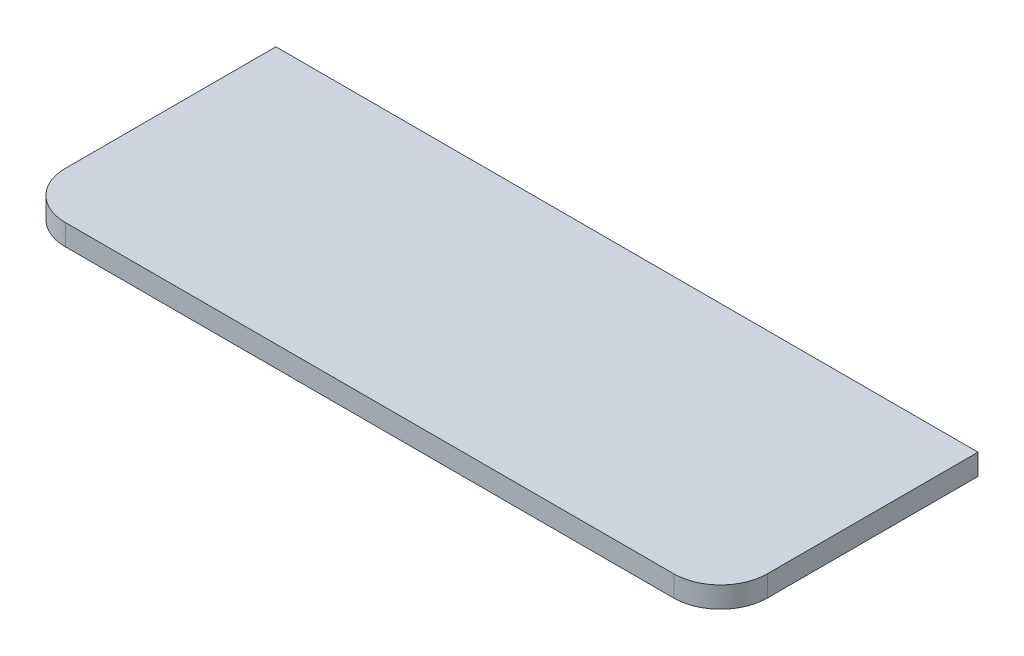
ISO-10303-21;
HEADER;
FILE_DESCRIPTION(('STEP AP214'),'2;1');
FILE_NAME('part.step','',(''),(''),'','','');
FILE_SCHEMA(('AUTOMOTIVE_DESIGN { 1 0 10303 214 1 1 1 1 }'));
ENDSEC;
DATA;
#1=APPLICATION_CONTEXT('core data for automotive mechanical design processes');
#2=APPLICATION_PROTOCOL_DEFINITION('international standard','automotive_design',2000,#1);
#3=PRODUCT_CONTEXT('',#1,'mechanical');
#4=PRODUCT('Part','Part','',(#3));
#5=PRODUCT_RELATED_PRODUCT_CATEGORY('part','',(#4));
#6=PRODUCT_DEFINITION_FORMATION('','',#4);
#7=PRODUCT_DEFINITION_CONTEXT('part definition',#1,'design');
#8=PRODUCT_DEFINITION('design','',#6,#7);
#9=PRODUCT_DEFINITION_SHAPE('','',#8);
#10=(LENGTH_UNIT() NAMED_UNIT(*) SI_UNIT(.MILLI.,.METRE.));
#11=(NAMED_UNIT(*) PLANE_ANGLE_UNIT() SI_UNIT($,.RADIAN.));
#12=(NAMED_UNIT(*) SI_UNIT($,.STERADIAN.) SOLID_ANGLE_UNIT());
#13=UNCERTAINTY_MEASURE_WITH_UNIT(LENGTH_MEASURE(1.E-05),#10,'distance_accuracy_value','');
#14=(GEOMETRIC_REPRESENTATION_CONTEXT(3) GLOBAL_UNCERTAINTY_ASSIGNED_CONTEXT((#13)) GLOBAL_UNIT_ASSIGNED_CONTEXT((#10,
#11,#12)) REPRESENTATION_CONTEXT('',''));
#15=CARTESIAN_POINT('',(0.,0.,0.));
#16=DIRECTION('',(0.,0.,1.));
#17=DIRECTION('',(1.,0.,0.));
#18=AXIS2_PLACEMENT_3D('',#15,#16,#17);
#19=CARTESIAN_POINT('',(-32.6549398788168,18.,-18.151418415666));
#20=DIRECTION('',(1.,0.,0.));
#21=DIRECTION('',(0.,0.,-1.));
#22=AXIS2_PLACEMENT_3D('',#19,#20,#21);
#23=PLANE('',#22);
#24=DIRECTION('',(0.,0.,1.));
#25=VECTOR('',#24,1.);
#26=CARTESIAN_POINT('',(-32.6549398788168,0.,-18.151418415666));
#27=LINE('',#26,#25);
#28=CARTESIAN_POINT('',(-32.6549398788168,0.,-18.151418415666));
#29=VERTEX_POINT('',#28);
#30=CARTESIAN_POINT('',(-32.6549398788168,0.,161.848581584334));
#31=VERTEX_POINT('',#30);
#32=EDGE_CURVE('E128',#29,#31,#27,.T.);
#33=ORIENTED_EDGE('',*,*,#32,.T.);
#34=DIRECTION('',(0.,-1.,0.));
#35=VECTOR('',#34,1.);
#36=CARTESIAN_POINT('',(-32.6549398788168,18.,161.848581584334));
#37=LINE('',#36,#35);
#38=CARTESIAN_POINT('',(-32.6549398788168,18.,161.848581584334));
#39=VERTEX_POINT('',#38);
#40=EDGE_CURVE('E13',#39,#31,#37,.T.);
#41=ORIENTED_EDGE('',*,*,#40,.F.);
#42=DIRECTION('',(0.,0.,1.));
#43=VECTOR('',#42,1.);
#44=CARTESIAN_POINT('',(-32.6549398788168,18.,-18.151418415666));
#45=LINE('',#44,#43);
#46=CARTESIAN_POINT('',(-32.6549398788168,18.,-18.151418415666));
#47=VERTEX_POINT('',#46);
#48=EDGE_CURVE('E138',#47,#39,#45,.T.);
#49=ORIENTED_EDGE('',*,*,#48,.F.);
#50=DIRECTION('',(0.,-1.,0.));
#51=VECTOR('',#50,1.);
#52=CARTESIAN_POINT('',(-32.6549398788168,18.,-18.151418415666));
#53=LINE('',#52,#51);
#54=EDGE_CURVE('E124',#47,#29,#53,.T.);
#55=ORIENTED_EDGE('',*,*,#54,.T.);
#56=EDGE_LOOP('',(#33,#41,#49,#55));
#57=FACE_BOUND('',#56,.T.);
#58=ADVANCED_FACE('F44',(#57),#23,.F.);
#59=CARTESIAN_POINT('',(7.34506012118324,18.,161.848581584334));
#60=DIRECTION('',(0.,-1.,0.));
#61=DIRECTION('',(0.,0.,-1.));
#62=AXIS2_PLACEMENT_3D('',#59,#60,#61);
#63=CYLINDRICAL_SURFACE('',#62,40.);
#64=CARTESIAN_POINT('',(7.34506012118324,0.,161.848581584334));
#65=DIRECTION('',(0.,1.,0.));
#66=DIRECTION('',(0.,0.,1.));
#67=AXIS2_PLACEMENT_3D('',#64,#65,#66);
#68=CIRCLE('',#67,40.);
#69=CARTESIAN_POINT('',(7.34506012118324,0.,201.848581584334));
#70=VERTEX_POINT('',#69);
#71=EDGE_CURVE('E131',#31,#70,#68,.T.);
#72=ORIENTED_EDGE('',*,*,#71,.T.);
#73=DIRECTION('',(0.,-1.,0.));
#74=VECTOR('',#73,1.);
#75=CARTESIAN_POINT('',(7.34506012118324,18.,201.848581584334));
#76=LINE('',#75,#74);
#77=CARTESIAN_POINT('',(7.34506012118324,18.,201.848581584334));
#78=VERTEX_POINT('',#77);
#79=EDGE_CURVE('E52',#78,#70,#76,.T.);
#80=ORIENTED_EDGE('',*,*,#79,.F.);
#81=CARTESIAN_POINT('',(7.34506012118324,18.,161.848581584334));
#82=DIRECTION('',(0.,1.,0.));
#83=DIRECTION('',(0.,0.,1.));
#84=AXIS2_PLACEMENT_3D('',#81,#82,#83);
#85=CIRCLE('',#84,40.);
#86=EDGE_CURVE('E97',#39,#78,#85,.T.);
#87=ORIENTED_EDGE('',*,*,#86,.F.);
#88=ORIENTED_EDGE('',*,*,#40,.T.);
#89=EDGE_LOOP('',(#72,#80,#87,#88));
#90=FACE_BOUND('',#89,.T.);
#91=ADVANCED_FACE('F162',(#90),#63,.T.);
#92=CARTESIAN_POINT('',(7.34506012118324,18.,201.848581584334));
#93=DIRECTION('',(0.,0.,-1.));
#94=DIRECTION('',(-1.,0.,0.));
#95=AXIS2_PLACEMENT_3D('',#92,#93,#94);
#96=PLANE('',#95);
#97=DIRECTION('',(1.,0.,0.));
#98=VECTOR('',#97,1.);
#99=CARTESIAN_POINT('',(7.34506012118324,0.,201.848581584334));
#100=LINE('',#99,#98);
#101=CARTESIAN_POINT('',(527.345060121183,0.,201.848581584334));
#102=VERTEX_POINT('',#101);
#103=EDGE_CURVE('E133',#70,#102,#100,.T.);
#104=ORIENTED_EDGE('',*,*,#103,.T.);
#105=DIRECTION('',(0.,-1.,0.));
#106=VECTOR('',#105,1.);
#107=CARTESIAN_POINT('',(527.345060121183,18.,201.848581584334));
#108=LINE('',#107,#106);
#109=CARTESIAN_POINT('',(527.345060121183,18.,201.848581584334));
#110=VERTEX_POINT('',#109);
#111=EDGE_CURVE('E119',#110,#102,#108,.T.);
#112=ORIENTED_EDGE('',*,*,#111,.F.);
#113=DIRECTION('',(1.,0.,0.));
#114=VECTOR('',#113,1.);
#115=CARTESIAN_POINT('',(7.34506012118324,18.,201.848581584334));
#116=LINE('',#115,#114);
#117=EDGE_CURVE('E110',#78,#110,#116,.T.);
#118=ORIENTED_EDGE('',*,*,#117,.F.);
#119=ORIENTED_EDGE('',*,*,#79,.T.);
#120=EDGE_LOOP('',(#104,#112,#118,#119));
#121=FACE_BOUND('',#120,.T.);
#122=ADVANCED_FACE('F144',(#121),#96,.F.);
#123=CARTESIAN_POINT('',(527.345060121183,18.,161.848581584334));
#124=DIRECTION('',(0.,-1.,0.));
#125=DIRECTION('',(0.,0.,-1.));
#126=AXIS2_PLACEMENT_3D('',#123,#124,#125);
#127=CYLINDRICAL_SURFACE('',#126,40.);
#128=CARTESIAN_POINT('',(527.345060121183,0.,161.848581584334));
#129=DIRECTION('',(0.,1.,0.));
#130=DIRECTION('',(0.,0.,1.));
#131=AXIS2_PLACEMENT_3D('',#128,#129,#130);
#132=CIRCLE('',#131,40.);
#133=CARTESIAN_POINT('',(567.345060121183,0.,161.848581584334));
#134=VERTEX_POINT('',#133);
#135=EDGE_CURVE('E118',#102,#134,#132,.T.);
#136=ORIENTED_EDGE('',*,*,#135,.T.);
#137=DIRECTION('',(0.,-1.,0.));
#138=VECTOR('',#137,1.);
#139=CARTESIAN_POINT('',(567.345060121183,18.,161.848581584334));
#140=LINE('',#139,#138);
#141=CARTESIAN_POINT('',(567.345060121183,18.,161.848581584334));
#142=VERTEX_POINT('',#141);
#143=EDGE_CURVE('E115',#142,#134,#140,.T.);
#144=ORIENTED_EDGE('',*,*,#143,.F.);
#145=CARTESIAN_POINT('',(527.345060121183,18.,161.848581584334));
#146=DIRECTION('',(0.,1.,0.));
#147=DIRECTION('',(0.,0.,1.));
#148=AXIS2_PLACEMENT_3D('',#145,#146,#147);
#149=CIRCLE('',#148,40.);
#150=EDGE_CURVE('E104',#110,#142,#149,.T.);
#151=ORIENTED_EDGE('',*,*,#150,.F.);
#152=ORIENTED_EDGE('',*,*,#111,.T.);
#153=EDGE_LOOP('',(#136,#144,#151,#152));
#154=FACE_BOUND('',#153,.T.);
#155=ADVANCED_FACE('F116',(#154),#127,.T.);
#156=CARTESIAN_POINT('',(567.345060121183,18.,-18.151418415666));
#157=DIRECTION('',(-1.,0.,0.));
#158=DIRECTION('',(0.,0.,1.));
#159=AXIS2_PLACEMENT_3D('',#156,#157,#158);
#160=PLANE('',#159);
#161=DIRECTION('',(0.,0.,-1.));
#162=VECTOR('',#161,1.);
#163=CARTESIAN_POINT('',(567.345060121183,0.,-18.151418415666));
#164=LINE('',#163,#162);
#165=CARTESIAN_POINT('',(567.345060121183,0.,-18.151418415666));
#166=VERTEX_POINT('',#165);
#167=EDGE_CURVE('E83',#134,#166,#164,.T.);
#168=ORIENTED_EDGE('',*,*,#167,.T.);
#169=DIRECTION('',(0.,-1.,0.));
#170=VECTOR('',#169,1.);
#171=CARTESIAN_POINT('',(567.345060121183,18.,-18.151418415666));
#172=LINE('',#171,#170);
#173=CARTESIAN_POINT('',(567.345060121183,18.,-18.151418415666));
#174=VERTEX_POINT('',#173);
#175=EDGE_CURVE('E120',#174,#166,#172,.T.);
#176=ORIENTED_EDGE('',*,*,#175,.F.);
#177=DIRECTION('',(0.,0.,-1.));
#178=VECTOR('',#177,1.);
#179=CARTESIAN_POINT('',(567.345060121183,18.,-18.151418415666));
#180=LINE('',#179,#178);
#181=EDGE_CURVE('E108',#142,#174,#180,.T.);
#182=ORIENTED_EDGE('',*,*,#181,.F.);
#183=ORIENTED_EDGE('',*,*,#143,.T.);
#184=EDGE_LOOP('',(#168,#176,#182,#183));
#185=FACE_BOUND('',#184,.T.);
#186=ADVANCED_FACE('F122',(#185),#160,.F.);
#187=CARTESIAN_POINT('',(-32.6549398788168,18.,-18.151418415666));
#188=DIRECTION('',(0.,0.,1.));
#189=DIRECTION('',(1.,0.,0.));
#190=AXIS2_PLACEMENT_3D('',#187,#188,#189);
#191=PLANE('',#190);
#192=DIRECTION('',(-1.,0.,0.));
#193=VECTOR('',#192,1.);
#194=CARTESIAN_POINT('',(-32.6549398788168,0.,-18.151418415666));
#195=LINE('',#194,#193);
#196=EDGE_CURVE('E89',#166,#29,#195,.T.);
#197=ORIENTED_EDGE('',*,*,#196,.T.);
#198=ORIENTED_EDGE('',*,*,#54,.F.);
#199=DIRECTION('',(-1.,0.,0.));
#200=VECTOR('',#199,1.);
#201=CARTESIAN_POINT('',(-32.6549398788168,18.,-18.151418415666));
#202=LINE('',#201,#200);
#203=EDGE_CURVE('E60',#174,#47,#202,.T.);
#204=ORIENTED_EDGE('',*,*,#203,.F.);
#205=ORIENTED_EDGE('',*,*,#175,.T.);
#206=EDGE_LOOP('',(#197,#198,#204,#205));
#207=FACE_BOUND('',#206,.T.);
#208=ADVANCED_FACE('F151',(#207),#191,.F.);
#209=CARTESIAN_POINT('',(7.34506012118324,18.,161.848581584334));
#210=DIRECTION('',(0.,1.,0.));
#211=DIRECTION('',(0.,0.,1.));
#212=AXIS2_PLACEMENT_3D('',#209,#210,#211);
#213=PLANE('',#212);
#214=ORIENTED_EDGE('',*,*,#48,.T.);
#215=ORIENTED_EDGE('',*,*,#86,.T.);
#216=ORIENTED_EDGE('',*,*,#117,.T.);
#217=ORIENTED_EDGE('',*,*,#150,.T.);
#218=ORIENTED_EDGE('',*,*,#181,.T.);
#219=ORIENTED_EDGE('',*,*,#203,.T.);
#220=EDGE_LOOP('',(#214,#215,#216,#217,#218,#219));
#221=FACE_BOUND('',#220,.T.);
#222=ADVANCED_FACE('F106',(#221),#213,.T.);
#223=CARTESIAN_POINT('',(7.34506012118324,0.,161.848581584334));
#224=DIRECTION('',(0.,1.,0.));
#225=DIRECTION('',(0.,0.,1.));
#226=AXIS2_PLACEMENT_3D('',#223,#224,#225);
#227=PLANE('',#226);
#228=ORIENTED_EDGE('',*,*,#32,.F.);
#229=ORIENTED_EDGE('',*,*,#196,.F.);
#230=ORIENTED_EDGE('',*,*,#167,.F.);
#231=ORIENTED_EDGE('',*,*,#135,.F.);
#232=ORIENTED_EDGE('',*,*,#103,.F.);
#233=ORIENTED_EDGE('',*,*,#71,.F.);
#234=EDGE_LOOP('',(#228,#229,#230,#231,#232,#233));
#235=FACE_BOUND('',#234,.T.);
#236=ADVANCED_FACE('F147',(#235),#227,.F.);
#237=CLOSED_SHELL('',(#58,#91,#122,#155,#186,#208,#222,#236));
#238=MANIFOLD_SOLID_BREP('B2',#237);
#239=ADVANCED_BREP_SHAPE_REPRESENTATION('',(#18,#238),#14);
#240=SHAPE_DEFINITION_REPRESENTATION(#9,#239);
ENDSEC;
END-ISO-10303-21;
